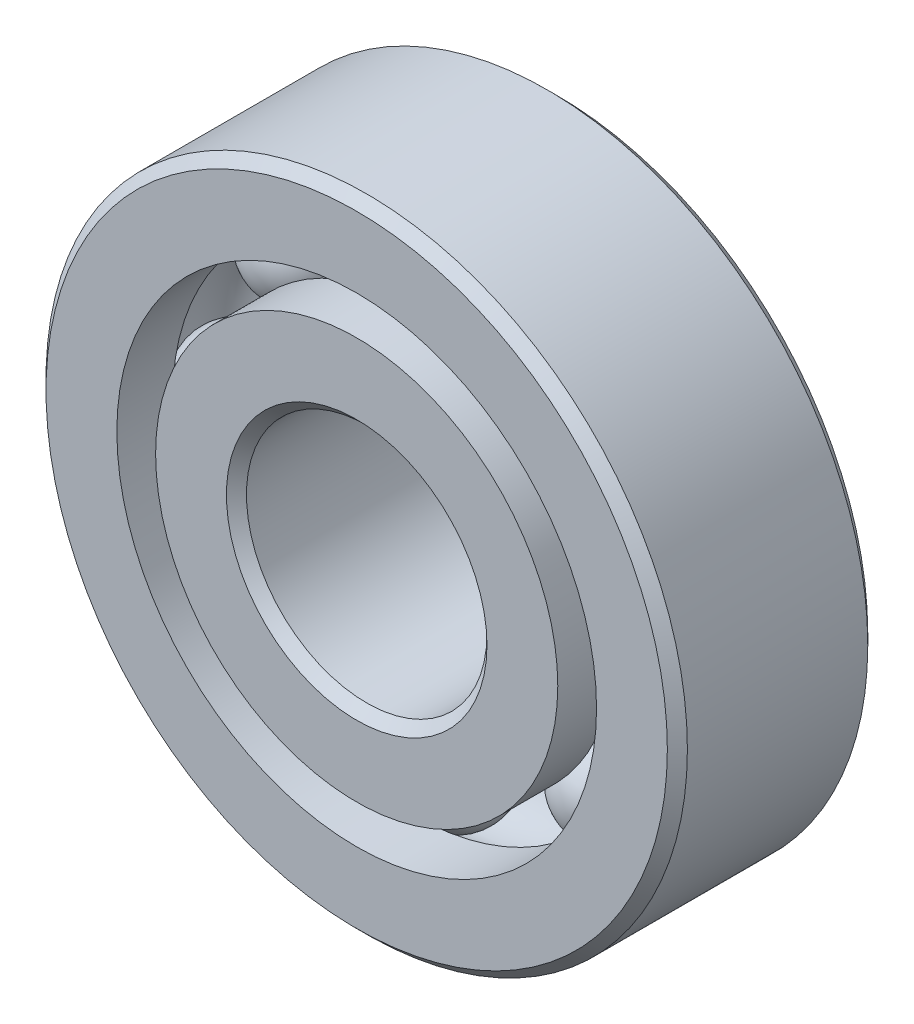
ISO-10303-21;
HEADER;
FILE_DESCRIPTION(('STEP AP214'),'2;1');
FILE_NAME('part.step','',(''),(''),'','','');
FILE_SCHEMA(('AUTOMOTIVE_DESIGN { 1 0 10303 214 1 1 1 1 }'));
ENDSEC;
DATA;
#1=APPLICATION_CONTEXT('core data for automotive mechanical design processes');
#2=APPLICATION_PROTOCOL_DEFINITION('international standard','automotive_design',2000,#1);
#3=PRODUCT_CONTEXT('',#1,'mechanical');
#4=PRODUCT('Part','Part','',(#3));
#5=PRODUCT_RELATED_PRODUCT_CATEGORY('part','',(#4));
#6=PRODUCT_DEFINITION_FORMATION('','',#4);
#7=PRODUCT_DEFINITION_CONTEXT('part definition',#1,'design');
#8=PRODUCT_DEFINITION('design','',#6,#7);
#9=PRODUCT_DEFINITION_SHAPE('','',#8);
#10=(LENGTH_UNIT() NAMED_UNIT(*) SI_UNIT(.MILLI.,.METRE.));
#11=(NAMED_UNIT(*) PLANE_ANGLE_UNIT() SI_UNIT($,.RADIAN.));
#12=(NAMED_UNIT(*) SI_UNIT($,.STERADIAN.) SOLID_ANGLE_UNIT());
#13=UNCERTAINTY_MEASURE_WITH_UNIT(LENGTH_MEASURE(1.E-05),#10,'distance_accuracy_value','');
#14=(GEOMETRIC_REPRESENTATION_CONTEXT(3) GLOBAL_UNCERTAINTY_ASSIGNED_CONTEXT((#13)) GLOBAL_UNIT_ASSIGNED_CONTEXT((#10,
#11,#12)) REPRESENTATION_CONTEXT('',''));
#15=CARTESIAN_POINT('',(0.,0.,0.));
#16=DIRECTION('',(0.,0.,1.));
#17=DIRECTION('',(1.,0.,0.));
#18=AXIS2_PLACEMENT_3D('',#15,#16,#17);
#19=CARTESIAN_POINT('',(-3.08696304161748,3.08696304161756,0.));
#20=DIRECTION('',(0.,0.,1.));
#21=DIRECTION('',(-0.707106781186539,0.707106781186556,0.));
#22=AXIS2_PLACEMENT_3D('',#19,#20,#21);
#23=SPHERICAL_SURFACE('',#22,0.961832467237323);
#24=CARTESIAN_POINT('',(-3.08696304161748,3.08696304161756,0.961832467237323));
#25=VERTEX_POINT('',#24);
#26=VERTEX_LOOP('',#25);
#27=FACE_BOUND('',#26,.T.);
#28=ADVANCED_FACE('F39',(#27),#23,.T.);
#29=CLOSED_SHELL('',(#28));
#30=MANIFOLD_SOLID_BREP('B2',#29);
#31=CARTESIAN_POINT('',(-4.365625,0.,0.));
#32=DIRECTION('',(0.,0.,1.));
#33=DIRECTION('',(-1.,0.,0.));
#34=AXIS2_PLACEMENT_3D('',#31,#32,#33);
#35=SPHERICAL_SURFACE('',#34,0.961832467237323);
#36=CARTESIAN_POINT('',(-4.365625,0.,0.961832467237323));
#37=VERTEX_POINT('',#36);
#38=VERTEX_LOOP('',#37);
#39=FACE_BOUND('',#38,.T.);
#40=ADVANCED_FACE('F59',(#39),#35,.T.);
#41=CLOSED_SHELL('',(#40));
#42=MANIFOLD_SOLID_BREP('B6',#41);
#43=CARTESIAN_POINT('',(-3.08696304161755,-3.08696304161749,0.));
#44=DIRECTION('',(0.,0.,1.));
#45=DIRECTION('',(-0.707106781186554,-0.707106781186541,0.));
#46=AXIS2_PLACEMENT_3D('',#43,#44,#45);
#47=SPHERICAL_SURFACE('',#46,0.961832467237323);
#48=CARTESIAN_POINT('',(-3.08696304161755,-3.08696304161749,0.961832467237323));
#49=VERTEX_POINT('',#48);
#50=VERTEX_LOOP('',#49);
#51=FACE_BOUND('',#50,.T.);
#52=ADVANCED_FACE('F79',(#51),#47,.T.);
#53=CLOSED_SHELL('',(#52));
#54=MANIFOLD_SOLID_BREP('B35',#53);
#55=CARTESIAN_POINT('',(0.,-4.365625,0.));
#56=DIRECTION('',(0.,0.,1.));
#57=DIRECTION('',(0.,-1.,0.));
#58=AXIS2_PLACEMENT_3D('',#55,#56,#57);
#59=SPHERICAL_SURFACE('',#58,0.961832467237323);
#60=CARTESIAN_POINT('',(0.,-4.365625,0.961832467237323));
#61=VERTEX_POINT('',#60);
#62=VERTEX_LOOP('',#61);
#63=FACE_BOUND('',#62,.T.);
#64=ADVANCED_FACE('F99',(#63),#59,.T.);
#65=CLOSED_SHELL('',(#64));
#66=MANIFOLD_SOLID_BREP('B55',#65);
#67=CARTESIAN_POINT('',(3.0869630416175,-3.08696304161754,0.));
#68=DIRECTION('',(0.,0.,1.));
#69=DIRECTION('',(0.707106781186544,-0.707106781186551,0.));
#70=AXIS2_PLACEMENT_3D('',#67,#68,#69);
#71=SPHERICAL_SURFACE('',#70,0.961832467237323);
#72=CARTESIAN_POINT('',(3.0869630416175,-3.08696304161754,0.961832467237323));
#73=VERTEX_POINT('',#72);
#74=VERTEX_LOOP('',#73);
#75=FACE_BOUND('',#74,.T.);
#76=ADVANCED_FACE('F119',(#75),#71,.T.);
#77=CLOSED_SHELL('',(#76));
#78=MANIFOLD_SOLID_BREP('B75',#77);
#79=CARTESIAN_POINT('',(4.365625,0.,0.));
#80=DIRECTION('',(0.,0.,1.));
#81=DIRECTION('',(1.,0.,0.));
#82=AXIS2_PLACEMENT_3D('',#79,#80,#81);
#83=SPHERICAL_SURFACE('',#82,0.961832467237323);
#84=CARTESIAN_POINT('',(4.365625,0.,0.961832467237323));
#85=VERTEX_POINT('',#84);
#86=VERTEX_LOOP('',#85);
#87=FACE_BOUND('',#86,.T.);
#88=ADVANCED_FACE('F139',(#87),#83,.T.);
#89=CLOSED_SHELL('',(#88));
#90=MANIFOLD_SOLID_BREP('B95',#89);
#91=CARTESIAN_POINT('',(3.08696304161753,3.08696304161752,0.));
#92=DIRECTION('',(0.,0.,1.));
#93=DIRECTION('',(0.707106781186549,0.707106781186546,0.));
#94=AXIS2_PLACEMENT_3D('',#91,#92,#93);
#95=SPHERICAL_SURFACE('',#94,0.961832467237323);
#96=CARTESIAN_POINT('',(3.08696304161753,3.08696304161752,0.961832467237323));
#97=VERTEX_POINT('',#96);
#98=VERTEX_LOOP('',#97);
#99=FACE_BOUND('',#98,.T.);
#100=ADVANCED_FACE('F159',(#99),#95,.T.);
#101=CLOSED_SHELL('',(#100));
#102=MANIFOLD_SOLID_BREP('B115',#101);
#103=CARTESIAN_POINT('',(0.,4.365625,0.));
#104=DIRECTION('',(0.,0.,1.));
#105=DIRECTION('',(0.,1.,0.));
#106=AXIS2_PLACEMENT_3D('',#103,#104,#105);
#107=SPHERICAL_SURFACE('',#106,0.961832467237323);
#108=CARTESIAN_POINT('',(0.,4.365625,0.961832467237323));
#109=VERTEX_POINT('',#108);
#110=VERTEX_LOOP('',#109);
#111=FACE_BOUND('',#110,.T.);
#112=ADVANCED_FACE('F181',(#111),#107,.T.);
#113=CLOSED_SHELL('',(#112));
#114=MANIFOLD_SOLID_BREP('B135',#113);
#115=CARTESIAN_POINT('',(0.,3.98183379120879,1.984375));
#116=DIRECTION('',(0.,0.,-1.));
#117=DIRECTION('',(-1.,0.,0.));
#118=AXIS2_PLACEMENT_3D('',#115,#116,#117);
#119=PLANE('',#118);
#120=CARTESIAN_POINT('',(0.,0.,1.984375));
#121=DIRECTION('',(0.,0.,1.));
#122=DIRECTION('',(1.,0.,0.));
#123=AXIS2_PLACEMENT_3D('',#120,#121,#122);
#124=CIRCLE('',#123,2.5796875);
#125=CARTESIAN_POINT('',(2.5796875,0.,1.984375));
#126=VERTEX_POINT('',#125);
#127=EDGE_CURVE('E228',#126,#126,#124,.T.);
#128=ORIENTED_EDGE('',*,*,#127,.F.);
#129=EDGE_LOOP('',(#128));
#130=FACE_BOUND('',#129,.T.);
#131=CARTESIAN_POINT('',(0.,0.,1.984375));
#132=DIRECTION('',(0.,0.,1.));
#133=DIRECTION('',(1.,0.,0.));
#134=AXIS2_PLACEMENT_3D('',#131,#132,#133);
#135=CIRCLE('',#134,3.98183379120879);
#136=CARTESIAN_POINT('',(3.98183379120879,0.,1.984375));
#137=VERTEX_POINT('',#136);
#138=EDGE_CURVE('E180',#137,#137,#135,.T.);
#139=ORIENTED_EDGE('',*,*,#138,.T.);
#140=EDGE_LOOP('',(#139));
#141=FACE_BOUND('',#140,.T.);
#142=ADVANCED_FACE('F200',(#130,#141),#119,.F.);
#143=CARTESIAN_POINT('',(0.,0.,1.984375));
#144=DIRECTION('',(0.,0.,1.));
#145=DIRECTION('',(1.,0.,0.));
#146=AXIS2_PLACEMENT_3D('',#143,#144,#145);
#147=CYLINDRICAL_SURFACE('',#146,3.98183379120879);
#148=ORIENTED_EDGE('',*,*,#138,.F.);
#149=EDGE_LOOP('',(#148));
#150=FACE_BOUND('',#149,.T.);
#151=CARTESIAN_POINT('',(0.,0.,0.881944444444444));
#152=DIRECTION('',(0.,0.,1.));
#153=DIRECTION('',(1.,0.,0.));
#154=AXIS2_PLACEMENT_3D('',#151,#152,#153);
#155=CIRCLE('',#154,3.98183379120879);
#156=CARTESIAN_POINT('',(3.98183379120879,0.,0.881944444444444));
#157=VERTEX_POINT('',#156);
#158=EDGE_CURVE('E206',#157,#157,#155,.T.);
#159=ORIENTED_EDGE('',*,*,#158,.T.);
#160=EDGE_LOOP('',(#159));
#161=FACE_BOUND('',#160,.T.);
#162=ADVANCED_FACE('F235',(#150,#161),#147,.T.);
#163=CARTESIAN_POINT('',(0.,0.,0.));
#164=DIRECTION('',(0.,0.,1.));
#165=DIRECTION('',(1.,0.,0.));
#166=AXIS2_PLACEMENT_3D('',#163,#164,#165);
#167=TOROIDAL_SURFACE('',#166,4.365625,0.961832467237322);
#168=ORIENTED_EDGE('',*,*,#158,.F.);
#169=EDGE_LOOP('',(#168));
#170=FACE_BOUND('',#169,.T.);
#171=CARTESIAN_POINT('',(0.,0.,-0.881944444444446));
#172=DIRECTION('',(0.,0.,1.));
#173=DIRECTION('',(1.,0.,0.));
#174=AXIS2_PLACEMENT_3D('',#171,#172,#173);
#175=CIRCLE('',#174,3.98183379120879);
#176=CARTESIAN_POINT('',(3.98183379120879,0.,-0.881944444444446));
#177=VERTEX_POINT('',#176);
#178=EDGE_CURVE('E210',#177,#177,#175,.T.);
#179=ORIENTED_EDGE('',*,*,#178,.T.);
#180=EDGE_LOOP('',(#179));
#181=FACE_BOUND('',#180,.T.);
#182=ADVANCED_FACE('F239',(#170,#181),#167,.F.);
#183=CARTESIAN_POINT('',(0.,0.,1.984375));
#184=DIRECTION('',(0.,0.,1.));
#185=DIRECTION('',(1.,0.,0.));
#186=AXIS2_PLACEMENT_3D('',#183,#184,#185);
#187=CYLINDRICAL_SURFACE('',#186,3.98183379120879);
#188=ORIENTED_EDGE('',*,*,#178,.F.);
#189=EDGE_LOOP('',(#188));
#190=FACE_BOUND('',#189,.T.);
#191=CARTESIAN_POINT('',(0.,0.,-1.984375));
#192=DIRECTION('',(0.,0.,1.));
#193=DIRECTION('',(1.,0.,0.));
#194=AXIS2_PLACEMENT_3D('',#191,#192,#193);
#195=CIRCLE('',#194,3.98183379120879);
#196=CARTESIAN_POINT('',(3.98183379120879,0.,-1.984375));
#197=VERTEX_POINT('',#196);
#198=EDGE_CURVE('E214',#197,#197,#195,.T.);
#199=ORIENTED_EDGE('',*,*,#198,.T.);
#200=EDGE_LOOP('',(#199));
#201=FACE_BOUND('',#200,.T.);
#202=ADVANCED_FACE('F244',(#190,#201),#187,.T.);
#203=CARTESIAN_POINT('',(0.,2.5796875,-1.984375));
#204=DIRECTION('',(0.,0.,1.));
#205=DIRECTION('',(1.,0.,0.));
#206=AXIS2_PLACEMENT_3D('',#203,#204,#205);
#207=PLANE('',#206);
#208=ORIENTED_EDGE('',*,*,#198,.F.);
#209=EDGE_LOOP('',(#208));
#210=FACE_BOUND('',#209,.T.);
#211=CARTESIAN_POINT('',(0.,0.,-1.984375));
#212=DIRECTION('',(0.,0.,1.));
#213=DIRECTION('',(1.,0.,0.));
#214=AXIS2_PLACEMENT_3D('',#211,#212,#213);
#215=CIRCLE('',#214,2.5796875);
#216=CARTESIAN_POINT('',(2.5796875,0.,-1.984375));
#217=VERTEX_POINT('',#216);
#218=EDGE_CURVE('E219',#217,#217,#215,.T.);
#219=ORIENTED_EDGE('',*,*,#218,.T.);
#220=EDGE_LOOP('',(#219));
#221=FACE_BOUND('',#220,.T.);
#222=ADVANCED_FACE('F250',(#210,#221),#207,.F.);
#223=CARTESIAN_POINT('',(0.,0.,-1.7859375));
#224=DIRECTION('',(0.,0.,-1.));
#225=DIRECTION('',(-1.,0.,0.));
#226=AXIS2_PLACEMENT_3D('',#223,#224,#225);
#227=CONICAL_SURFACE('',#226,2.38125,0.785398163397443);
#228=ORIENTED_EDGE('',*,*,#218,.F.);
#229=EDGE_LOOP('',(#228));
#230=FACE_BOUND('',#229,.T.);
#231=CARTESIAN_POINT('',(0.,0.,-1.7859375));
#232=DIRECTION('',(0.,0.,1.));
#233=DIRECTION('',(1.,0.,0.));
#234=AXIS2_PLACEMENT_3D('',#231,#232,#233);
#235=CIRCLE('',#234,2.38125);
#236=CARTESIAN_POINT('',(2.38125,0.,-1.7859375));
#237=VERTEX_POINT('',#236);
#238=EDGE_CURVE('E222',#237,#237,#235,.T.);
#239=ORIENTED_EDGE('',*,*,#238,.T.);
#240=EDGE_LOOP('',(#239));
#241=FACE_BOUND('',#240,.T.);
#242=ADVANCED_FACE('F254',(#230,#241),#227,.F.);
#243=CARTESIAN_POINT('',(0.,0.,1.984375));
#244=DIRECTION('',(0.,0.,1.));
#245=DIRECTION('',(1.,0.,0.));
#246=AXIS2_PLACEMENT_3D('',#243,#244,#245);
#247=CYLINDRICAL_SURFACE('',#246,2.38125);
#248=ORIENTED_EDGE('',*,*,#238,.F.);
#249=EDGE_LOOP('',(#248));
#250=FACE_BOUND('',#249,.T.);
#251=CARTESIAN_POINT('',(0.,0.,1.7859375));
#252=DIRECTION('',(0.,0.,1.));
#253=DIRECTION('',(1.,0.,0.));
#254=AXIS2_PLACEMENT_3D('',#251,#252,#253);
#255=CIRCLE('',#254,2.38125);
#256=CARTESIAN_POINT('',(2.38125,0.,1.7859375));
#257=VERTEX_POINT('',#256);
#258=EDGE_CURVE('E225',#257,#257,#255,.T.);
#259=ORIENTED_EDGE('',*,*,#258,.T.);
#260=EDGE_LOOP('',(#259));
#261=FACE_BOUND('',#260,.T.);
#262=ADVANCED_FACE('F258',(#250,#261),#247,.F.);
#263=CARTESIAN_POINT('',(0.,0.,1.984375));
#264=DIRECTION('',(0.,0.,1.));
#265=DIRECTION('',(1.,0.,0.));
#266=AXIS2_PLACEMENT_3D('',#263,#264,#265);
#267=CONICAL_SURFACE('',#266,2.5796875,0.785398163397454);
#268=ORIENTED_EDGE('',*,*,#258,.F.);
#269=EDGE_LOOP('',(#268));
#270=FACE_BOUND('',#269,.T.);
#271=ORIENTED_EDGE('',*,*,#127,.T.);
#272=EDGE_LOOP('',(#271));
#273=FACE_BOUND('',#272,.T.);
#274=ADVANCED_FACE('F232',(#270,#273),#267,.F.);
#275=CLOSED_SHELL('',(#142,#162,#182,#202,#222,#242,#262,#274));
#276=MANIFOLD_SOLID_BREP('B155',#275);
#277=CARTESIAN_POINT('',(0.,0.,1.7859375));
#278=DIRECTION('',(0.,0.,-1.));
#279=DIRECTION('',(-1.,0.,0.));
#280=AXIS2_PLACEMENT_3D('',#277,#278,#279);
#281=CONICAL_SURFACE('',#280,6.35,0.785398163397446);
#282=CARTESIAN_POINT('',(0.,0.,1.984375));
#283=DIRECTION('',(0.,0.,1.));
#284=DIRECTION('',(1.,0.,0.));
#285=AXIS2_PLACEMENT_3D('',#282,#283,#284);
#286=CIRCLE('',#285,6.1515625);
#287=CARTESIAN_POINT('',(6.1515625,0.,1.984375));
#288=VERTEX_POINT('',#287);
#289=EDGE_CURVE('E349',#288,#288,#286,.T.);
#290=ORIENTED_EDGE('',*,*,#289,.F.);
#291=EDGE_LOOP('',(#290));
#292=FACE_BOUND('',#291,.T.);
#293=CARTESIAN_POINT('',(0.,0.,1.7859375));
#294=DIRECTION('',(0.,0.,1.));
#295=DIRECTION('',(1.,0.,0.));
#296=AXIS2_PLACEMENT_3D('',#293,#294,#295);
#297=CIRCLE('',#296,6.35);
#298=CARTESIAN_POINT('',(6.35,0.,1.7859375));
#299=VERTEX_POINT('',#298);
#300=EDGE_CURVE('E199',#299,#299,#297,.T.);
#301=ORIENTED_EDGE('',*,*,#300,.T.);
#302=EDGE_LOOP('',(#301));
#303=FACE_BOUND('',#302,.T.);
#304=ADVANCED_FACE('F321',(#292,#303),#281,.T.);
#305=CARTESIAN_POINT('',(0.,0.,1.984375));
#306=DIRECTION('',(0.,0.,1.));
#307=DIRECTION('',(1.,0.,0.));
#308=AXIS2_PLACEMENT_3D('',#305,#306,#307);
#309=CYLINDRICAL_SURFACE('',#308,6.35);
#310=ORIENTED_EDGE('',*,*,#300,.F.);
#311=EDGE_LOOP('',(#310));
#312=FACE_BOUND('',#311,.T.);
#313=CARTESIAN_POINT('',(0.,0.,-1.7859375));
#314=DIRECTION('',(0.,0.,1.));
#315=DIRECTION('',(1.,0.,0.));
#316=AXIS2_PLACEMENT_3D('',#313,#314,#315);
#317=CIRCLE('',#316,6.35);
#318=CARTESIAN_POINT('',(6.35,0.,-1.7859375));
#319=VERTEX_POINT('',#318);
#320=EDGE_CURVE('E327',#319,#319,#317,.T.);
#321=ORIENTED_EDGE('',*,*,#320,.T.);
#322=EDGE_LOOP('',(#321));
#323=FACE_BOUND('',#322,.T.);
#324=ADVANCED_FACE('F356',(#312,#323),#309,.T.);
#325=CARTESIAN_POINT('',(0.,0.,-1.984375));
#326=DIRECTION('',(0.,0.,1.));
#327=DIRECTION('',(1.,0.,0.));
#328=AXIS2_PLACEMENT_3D('',#325,#326,#327);
#329=CONICAL_SURFACE('',#328,6.1515625,0.785398163397444);
#330=ORIENTED_EDGE('',*,*,#320,.F.);
#331=EDGE_LOOP('',(#330));
#332=FACE_BOUND('',#331,.T.);
#333=CARTESIAN_POINT('',(0.,0.,-1.984375));
#334=DIRECTION('',(0.,0.,1.));
#335=DIRECTION('',(1.,0.,0.));
#336=AXIS2_PLACEMENT_3D('',#333,#334,#335);
#337=CIRCLE('',#336,6.1515625);
#338=CARTESIAN_POINT('',(6.1515625,0.,-1.984375));
#339=VERTEX_POINT('',#338);
#340=EDGE_CURVE('E331',#339,#339,#337,.T.);
#341=ORIENTED_EDGE('',*,*,#340,.T.);
#342=EDGE_LOOP('',(#341));
#343=FACE_BOUND('',#342,.T.);
#344=ADVANCED_FACE('F360',(#332,#343),#329,.T.);
#345=CARTESIAN_POINT('',(0.,6.1515625,-1.984375));
#346=DIRECTION('',(0.,0.,1.));
#347=DIRECTION('',(1.,0.,0.));
#348=AXIS2_PLACEMENT_3D('',#345,#346,#347);
#349=PLANE('',#348);
#350=ORIENTED_EDGE('',*,*,#340,.F.);
#351=EDGE_LOOP('',(#350));
#352=FACE_BOUND('',#351,.T.);
#353=CARTESIAN_POINT('',(0.,0.,-1.984375));
#354=DIRECTION('',(0.,0.,1.));
#355=DIRECTION('',(1.,0.,0.));
#356=AXIS2_PLACEMENT_3D('',#353,#354,#355);
#357=CIRCLE('',#356,4.74941620879121);
#358=CARTESIAN_POINT('',(4.74941620879121,0.,-1.984375));
#359=VERTEX_POINT('',#358);
#360=EDGE_CURVE('E335',#359,#359,#357,.T.);
#361=ORIENTED_EDGE('',*,*,#360,.T.);
#362=EDGE_LOOP('',(#361));
#363=FACE_BOUND('',#362,.T.);
#364=ADVANCED_FACE('F365',(#352,#363),#349,.F.);
#365=CARTESIAN_POINT('',(0.,0.,1.984375));
#366=DIRECTION('',(0.,0.,1.));
#367=DIRECTION('',(1.,0.,0.));
#368=AXIS2_PLACEMENT_3D('',#365,#366,#367);
#369=CYLINDRICAL_SURFACE('',#368,4.74941620879121);
#370=ORIENTED_EDGE('',*,*,#360,.F.);
#371=EDGE_LOOP('',(#370));
#372=FACE_BOUND('',#371,.T.);
#373=CARTESIAN_POINT('',(0.,0.,-0.881944444444445));
#374=DIRECTION('',(0.,0.,1.));
#375=DIRECTION('',(1.,0.,0.));
#376=AXIS2_PLACEMENT_3D('',#373,#374,#375);
#377=CIRCLE('',#376,4.74941620879121);
#378=CARTESIAN_POINT('',(4.74941620879121,0.,-0.881944444444445));
#379=VERTEX_POINT('',#378);
#380=EDGE_CURVE('E340',#379,#379,#377,.T.);
#381=ORIENTED_EDGE('',*,*,#380,.T.);
#382=EDGE_LOOP('',(#381));
#383=FACE_BOUND('',#382,.T.);
#384=ADVANCED_FACE('F371',(#372,#383),#369,.F.);
#385=CARTESIAN_POINT('',(0.,0.,0.));
#386=DIRECTION('',(0.,0.,1.));
#387=DIRECTION('',(1.,0.,0.));
#388=AXIS2_PLACEMENT_3D('',#385,#386,#387);
#389=TOROIDAL_SURFACE('',#388,4.365625,0.961832467237323);
#390=ORIENTED_EDGE('',*,*,#380,.F.);
#391=EDGE_LOOP('',(#390));
#392=FACE_BOUND('',#391,.T.);
#393=CARTESIAN_POINT('',(0.,0.,0.881944444444444));
#394=DIRECTION('',(0.,0.,1.));
#395=DIRECTION('',(1.,0.,0.));
#396=AXIS2_PLACEMENT_3D('',#393,#394,#395);
#397=CIRCLE('',#396,4.74941620879121);
#398=CARTESIAN_POINT('',(4.74941620879121,0.,0.881944444444444));
#399=VERTEX_POINT('',#398);
#400=EDGE_CURVE('E343',#399,#399,#397,.T.);
#401=ORIENTED_EDGE('',*,*,#400,.T.);
#402=EDGE_LOOP('',(#401));
#403=FACE_BOUND('',#402,.T.);
#404=ADVANCED_FACE('F375',(#392,#403),#389,.F.);
#405=CARTESIAN_POINT('',(0.,0.,1.984375));
#406=DIRECTION('',(0.,0.,1.));
#407=DIRECTION('',(1.,0.,0.));
#408=AXIS2_PLACEMENT_3D('',#405,#406,#407);
#409=CYLINDRICAL_SURFACE('',#408,4.74941620879121);
#410=ORIENTED_EDGE('',*,*,#400,.F.);
#411=EDGE_LOOP('',(#410));
#412=FACE_BOUND('',#411,.T.);
#413=CARTESIAN_POINT('',(0.,0.,1.984375));
#414=DIRECTION('',(0.,0.,1.));
#415=DIRECTION('',(1.,0.,0.));
#416=AXIS2_PLACEMENT_3D('',#413,#414,#415);
#417=CIRCLE('',#416,4.74941620879121);
#418=CARTESIAN_POINT('',(4.74941620879121,0.,1.984375));
#419=VERTEX_POINT('',#418);
#420=EDGE_CURVE('E346',#419,#419,#417,.T.);
#421=ORIENTED_EDGE('',*,*,#420,.T.);
#422=EDGE_LOOP('',(#421));
#423=FACE_BOUND('',#422,.T.);
#424=ADVANCED_FACE('F379',(#412,#423),#409,.F.);
#425=CARTESIAN_POINT('',(0.,6.1515625,1.984375));
#426=DIRECTION('',(0.,0.,-1.));
#427=DIRECTION('',(-1.,0.,0.));
#428=AXIS2_PLACEMENT_3D('',#425,#426,#427);
#429=PLANE('',#428);
#430=ORIENTED_EDGE('',*,*,#420,.F.);
#431=EDGE_LOOP('',(#430));
#432=FACE_BOUND('',#431,.T.);
#433=ORIENTED_EDGE('',*,*,#289,.T.);
#434=EDGE_LOOP('',(#433));
#435=FACE_BOUND('',#434,.T.);
#436=ADVANCED_FACE('F353',(#432,#435),#429,.F.);
#437=CLOSED_SHELL('',(#304,#324,#344,#364,#384,#404,#424,#436));
#438=MANIFOLD_SOLID_BREP('B175',#437);
#439=ADVANCED_BREP_SHAPE_REPRESENTATION('',(#18,#30,#42,#54,#66,#78,#90,#102,#114,#276,#438),#14);
#440=SHAPE_DEFINITION_REPRESENTATION(#9,#439);
ENDSEC;
END-ISO-10303-21;
